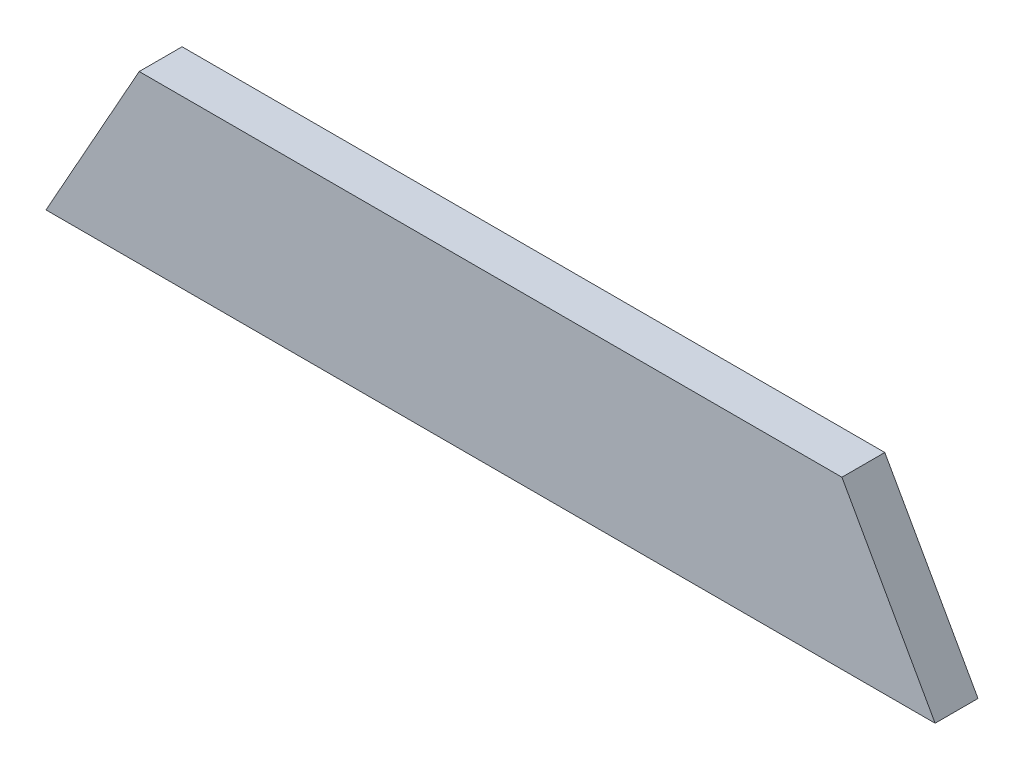
ISO-10303-21;
HEADER;
FILE_DESCRIPTION(('STEP AP214'),'2;1');
FILE_NAME('part.step','',(''),(''),'','','');
FILE_SCHEMA(('AUTOMOTIVE_DESIGN { 1 0 10303 214 1 1 1 1 }'));
ENDSEC;
DATA;
#1=APPLICATION_CONTEXT('core data for automotive mechanical design processes');
#2=APPLICATION_PROTOCOL_DEFINITION('international standard','automotive_design',2000,#1);
#3=PRODUCT_CONTEXT('',#1,'mechanical');
#4=PRODUCT('Part','Part','',(#3));
#5=PRODUCT_RELATED_PRODUCT_CATEGORY('part','',(#4));
#6=PRODUCT_DEFINITION_FORMATION('','',#4);
#7=PRODUCT_DEFINITION_CONTEXT('part definition',#1,'design');
#8=PRODUCT_DEFINITION('design','',#6,#7);
#9=PRODUCT_DEFINITION_SHAPE('','',#8);
#10=(LENGTH_UNIT() NAMED_UNIT(*) SI_UNIT(.MILLI.,.METRE.));
#11=(NAMED_UNIT(*) PLANE_ANGLE_UNIT() SI_UNIT($,.RADIAN.));
#12=(NAMED_UNIT(*) SI_UNIT($,.STERADIAN.) SOLID_ANGLE_UNIT());
#13=UNCERTAINTY_MEASURE_WITH_UNIT(LENGTH_MEASURE(1.E-05),#10,'distance_accuracy_value','');
#14=(GEOMETRIC_REPRESENTATION_CONTEXT(3) GLOBAL_UNCERTAINTY_ASSIGNED_CONTEXT((#13)) GLOBAL_UNIT_ASSIGNED_CONTEXT((#10,
#11,#12)) REPRESENTATION_CONTEXT('',''));
#15=CARTESIAN_POINT('',(0.,0.,0.));
#16=DIRECTION('',(0.,0.,1.));
#17=DIRECTION('',(1.,0.,0.));
#18=AXIS2_PLACEMENT_3D('',#15,#16,#17);
#19=CARTESIAN_POINT('',(0.,0.,4.6));
#20=DIRECTION('',(0.872552817664029,-0.488519785051295,0.));
#21=DIRECTION('',(0.488519785051295,0.872552817664029,0.));
#22=AXIS2_PLACEMENT_3D('',#19,#20,#21);
#23=PLANE('',#22);
#24=DIRECTION('',(-0.488519785051295,-0.872552817664029,0.));
#25=VECTOR('',#24,1.);
#26=CARTESIAN_POINT('',(0.,0.,0.));
#27=LINE('',#26,#25);
#28=CARTESIAN_POINT('',(0.,0.,0.));
#29=VERTEX_POINT('',#28);
#30=CARTESIAN_POINT('',(-10.,-17.8611561775827,0.));
#31=VERTEX_POINT('',#30);
#32=EDGE_CURVE('E96',#29,#31,#27,.T.);
#33=ORIENTED_EDGE('',*,*,#32,.T.);
#34=DIRECTION('',(0.,0.,-1.));
#35=VECTOR('',#34,1.);
#36=CARTESIAN_POINT('',(-10.,-17.8611561775827,4.6));
#37=LINE('',#36,#35);
#38=CARTESIAN_POINT('',(-10.,-17.8611561775827,4.6));
#39=VERTEX_POINT('',#38);
#40=EDGE_CURVE('E11',#39,#31,#37,.T.);
#41=ORIENTED_EDGE('',*,*,#40,.F.);
#42=DIRECTION('',(-0.488519785051295,-0.872552817664029,0.));
#43=VECTOR('',#42,1.);
#44=CARTESIAN_POINT('',(0.,0.,4.6));
#45=LINE('',#44,#43);
#46=CARTESIAN_POINT('',(0.,0.,4.6));
#47=VERTEX_POINT('',#46);
#48=EDGE_CURVE('E84',#47,#39,#45,.T.);
#49=ORIENTED_EDGE('',*,*,#48,.F.);
#50=DIRECTION('',(0.,0.,-1.));
#51=VECTOR('',#50,1.);
#52=CARTESIAN_POINT('',(0.,0.,4.6));
#53=LINE('',#52,#51);
#54=EDGE_CURVE('E92',#47,#29,#53,.T.);
#55=ORIENTED_EDGE('',*,*,#54,.T.);
#56=EDGE_LOOP('',(#33,#41,#49,#55));
#57=FACE_BOUND('',#56,.T.);
#58=ADVANCED_FACE('F33',(#57),#23,.F.);
#59=CARTESIAN_POINT('',(-10.,-17.8611561775827,4.6));
#60=DIRECTION('',(0.,1.,0.));
#61=DIRECTION('',(-1.,0.,0.));
#62=AXIS2_PLACEMENT_3D('',#59,#60,#61);
#63=PLANE('',#62);
#64=DIRECTION('',(1.,0.,0.));
#65=VECTOR('',#64,1.);
#66=CARTESIAN_POINT('',(-10.,-17.8611561775827,0.));
#67=LINE('',#66,#65);
#68=CARTESIAN_POINT('',(85.4,-17.8611561775827,0.));
#69=VERTEX_POINT('',#68);
#70=EDGE_CURVE('E88',#31,#69,#67,.T.);
#71=ORIENTED_EDGE('',*,*,#70,.T.);
#72=DIRECTION('',(0.,0.,-1.));
#73=VECTOR('',#72,1.);
#74=CARTESIAN_POINT('',(85.4,-17.8611561775827,4.6));
#75=LINE('',#74,#73);
#76=CARTESIAN_POINT('',(85.4,-17.8611561775827,4.6));
#77=VERTEX_POINT('',#76);
#78=EDGE_CURVE('E41',#77,#69,#75,.T.);
#79=ORIENTED_EDGE('',*,*,#78,.F.);
#80=DIRECTION('',(1.,0.,0.));
#81=VECTOR('',#80,1.);
#82=CARTESIAN_POINT('',(-10.,-17.8611561775827,4.6));
#83=LINE('',#82,#81);
#84=EDGE_CURVE('E79',#39,#77,#83,.T.);
#85=ORIENTED_EDGE('',*,*,#84,.F.);
#86=ORIENTED_EDGE('',*,*,#40,.T.);
#87=EDGE_LOOP('',(#71,#79,#85,#86));
#88=FACE_BOUND('',#87,.T.);
#89=ADVANCED_FACE('F87',(#88),#63,.F.);
#90=CARTESIAN_POINT('',(75.4,0.,4.6));
#91=DIRECTION('',(-0.872552817664029,-0.488519785051295,0.));
#92=DIRECTION('',(0.488519785051295,-0.87255281766403,0.));
#93=AXIS2_PLACEMENT_3D('',#90,#91,#92);
#94=PLANE('',#93);
#95=DIRECTION('',(-0.488519785051295,0.87255281766403,0.));
#96=VECTOR('',#95,1.);
#97=CARTESIAN_POINT('',(75.4,0.,0.));
#98=LINE('',#97,#96);
#99=CARTESIAN_POINT('',(75.4,0.,0.));
#100=VERTEX_POINT('',#99);
#101=EDGE_CURVE('E66',#69,#100,#98,.T.);
#102=ORIENTED_EDGE('',*,*,#101,.T.);
#103=DIRECTION('',(0.,0.,-1.));
#104=VECTOR('',#103,1.);
#105=CARTESIAN_POINT('',(75.4,0.,4.6));
#106=LINE('',#105,#104);
#107=CARTESIAN_POINT('',(75.4,0.,4.6));
#108=VERTEX_POINT('',#107);
#109=EDGE_CURVE('E89',#108,#100,#106,.T.);
#110=ORIENTED_EDGE('',*,*,#109,.F.);
#111=DIRECTION('',(-0.488519785051295,0.87255281766403,0.));
#112=VECTOR('',#111,1.);
#113=CARTESIAN_POINT('',(75.4,0.,4.6));
#114=LINE('',#113,#112);
#115=EDGE_CURVE('E82',#77,#108,#114,.T.);
#116=ORIENTED_EDGE('',*,*,#115,.F.);
#117=ORIENTED_EDGE('',*,*,#78,.T.);
#118=EDGE_LOOP('',(#102,#110,#116,#117));
#119=FACE_BOUND('',#118,.T.);
#120=ADVANCED_FACE('F90',(#119),#94,.F.);
#121=CARTESIAN_POINT('',(0.,0.,4.6));
#122=DIRECTION('',(0.,-1.,0.));
#123=DIRECTION('',(0.,0.,-1.));
#124=AXIS2_PLACEMENT_3D('',#121,#122,#123);
#125=PLANE('',#124);
#126=DIRECTION('',(-1.,0.,0.));
#127=VECTOR('',#126,1.);
#128=CARTESIAN_POINT('',(0.,0.,0.));
#129=LINE('',#128,#127);
#130=EDGE_CURVE('E72',#100,#29,#129,.T.);
#131=ORIENTED_EDGE('',*,*,#130,.T.);
#132=ORIENTED_EDGE('',*,*,#54,.F.);
#133=DIRECTION('',(-1.,0.,0.));
#134=VECTOR('',#133,1.);
#135=CARTESIAN_POINT('',(0.,0.,4.6));
#136=LINE('',#135,#134);
#137=EDGE_CURVE('E49',#108,#47,#136,.T.);
#138=ORIENTED_EDGE('',*,*,#137,.F.);
#139=ORIENTED_EDGE('',*,*,#109,.T.);
#140=EDGE_LOOP('',(#131,#132,#138,#139));
#141=FACE_BOUND('',#140,.T.);
#142=ADVANCED_FACE('F103',(#141),#125,.F.);
#143=CARTESIAN_POINT('',(-10.,-17.8611561775827,4.6));
#144=DIRECTION('',(0.,0.,1.));
#145=DIRECTION('',(1.,0.,0.));
#146=AXIS2_PLACEMENT_3D('',#143,#144,#145);
#147=PLANE('',#146);
#148=ORIENTED_EDGE('',*,*,#48,.T.);
#149=ORIENTED_EDGE('',*,*,#84,.T.);
#150=ORIENTED_EDGE('',*,*,#115,.T.);
#151=ORIENTED_EDGE('',*,*,#137,.T.);
#152=EDGE_LOOP('',(#148,#149,#150,#151));
#153=FACE_BOUND('',#152,.T.);
#154=ADVANCED_FACE('F80',(#153),#147,.T.);
#155=CARTESIAN_POINT('',(-10.,-17.8611561775827,0.));
#156=DIRECTION('',(0.,0.,1.));
#157=DIRECTION('',(1.,0.,0.));
#158=AXIS2_PLACEMENT_3D('',#155,#156,#157);
#159=PLANE('',#158);
#160=ORIENTED_EDGE('',*,*,#32,.F.);
#161=ORIENTED_EDGE('',*,*,#130,.F.);
#162=ORIENTED_EDGE('',*,*,#101,.F.);
#163=ORIENTED_EDGE('',*,*,#70,.F.);
#164=EDGE_LOOP('',(#160,#161,#162,#163));
#165=FACE_BOUND('',#164,.T.);
#166=ADVANCED_FACE('F106',(#165),#159,.F.);
#167=CLOSED_SHELL('',(#58,#89,#120,#142,#154,#166));
#168=MANIFOLD_SOLID_BREP('B2',#167);
#169=ADVANCED_BREP_SHAPE_REPRESENTATION('',(#18,#168),#14);
#170=SHAPE_DEFINITION_REPRESENTATION(#9,#169);
ENDSEC;
END-ISO-10303-21;
